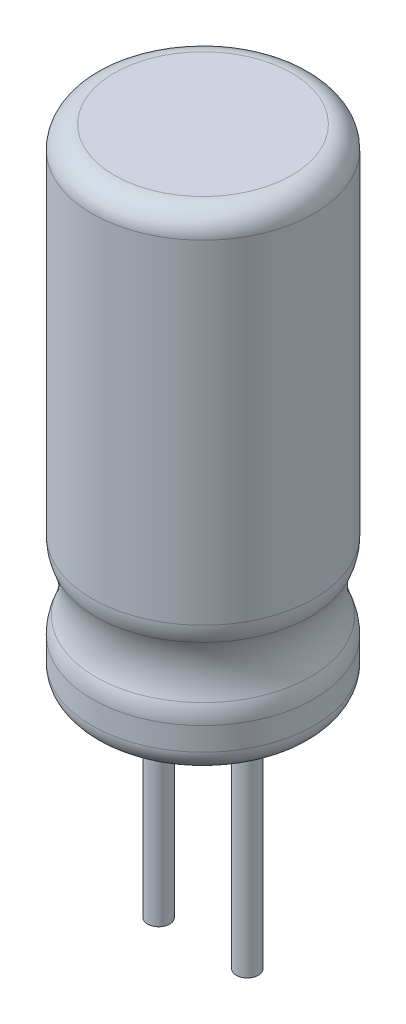
ISO-10303-21;
HEADER;
FILE_DESCRIPTION(('STEP AP214'),'2;1');
FILE_NAME('part.step','',(''),(''),'','','');
FILE_SCHEMA(('AUTOMOTIVE_DESIGN { 1 0 10303 214 1 1 1 1 }'));
ENDSEC;
DATA;
#1=APPLICATION_CONTEXT('core data for automotive mechanical design processes');
#2=APPLICATION_PROTOCOL_DEFINITION('international standard','automotive_design',2000,#1);
#3=PRODUCT_CONTEXT('',#1,'mechanical');
#4=PRODUCT('Part','Part','',(#3));
#5=PRODUCT_RELATED_PRODUCT_CATEGORY('part','',(#4));
#6=PRODUCT_DEFINITION_FORMATION('','',#4);
#7=PRODUCT_DEFINITION_CONTEXT('part definition',#1,'design');
#8=PRODUCT_DEFINITION('design','',#6,#7);
#9=PRODUCT_DEFINITION_SHAPE('','',#8);
#10=(LENGTH_UNIT() NAMED_UNIT(*) SI_UNIT(.MILLI.,.METRE.));
#11=(NAMED_UNIT(*) PLANE_ANGLE_UNIT() SI_UNIT($,.RADIAN.));
#12=(NAMED_UNIT(*) SI_UNIT($,.STERADIAN.) SOLID_ANGLE_UNIT());
#13=UNCERTAINTY_MEASURE_WITH_UNIT(LENGTH_MEASURE(1.E-05),#10,'distance_accuracy_value','');
#14=(GEOMETRIC_REPRESENTATION_CONTEXT(3) GLOBAL_UNCERTAINTY_ASSIGNED_CONTEXT((#13)) GLOBAL_UNIT_ASSIGNED_CONTEXT((#10,
#11,#12)) REPRESENTATION_CONTEXT('',''));
#15=CARTESIAN_POINT('',(0.,0.,0.));
#16=DIRECTION('',(0.,0.,1.));
#17=DIRECTION('',(1.,0.,0.));
#18=AXIS2_PLACEMENT_3D('',#15,#16,#17);
#19=CARTESIAN_POINT('',(0.,11.,0.));
#20=DIRECTION('',(0.,-1.,0.));
#21=DIRECTION('',(0.,0.,-1.));
#22=AXIS2_PLACEMENT_3D('',#19,#20,#21);
#23=CYLINDRICAL_SURFACE('',#22,2.5);
#24=CARTESIAN_POINT('',(0.,0.5,0.));
#25=DIRECTION('',(0.,1.,0.));
#26=DIRECTION('',(0.,0.,1.));
#27=AXIS2_PLACEMENT_3D('',#24,#25,#26);
#28=CIRCLE('',#27,2.5);
#29=CARTESIAN_POINT('',(0.,0.5,2.5));
#30=VERTEX_POINT('',#29);
#31=EDGE_CURVE('E51',#30,#30,#28,.T.);
#32=ORIENTED_EDGE('',*,*,#31,.T.);
#33=EDGE_LOOP('',(#32));
#34=FACE_BOUND('',#33,.T.);
#35=CARTESIAN_POINT('',(0.,1.02020410288673,0.));
#36=DIRECTION('',(0.,-1.,0.));
#37=DIRECTION('',(0.,0.,-1.));
#38=AXIS2_PLACEMENT_3D('',#35,#36,#37);
#39=CIRCLE('',#38,2.5);
#40=CARTESIAN_POINT('',(0.,1.02020410288673,-2.5));
#41=VERTEX_POINT('',#40);
#42=EDGE_CURVE('E75',#41,#41,#39,.T.);
#43=ORIENTED_EDGE('',*,*,#42,.T.);
#44=EDGE_LOOP('',(#43));
#45=FACE_BOUND('',#44,.T.);
#46=ADVANCED_FACE('F43',(#34,#45),#23,.T.);
#47=CARTESIAN_POINT('',(0.,0.,0.));
#48=DIRECTION('',(0.,1.,0.));
#49=DIRECTION('',(0.,0.,1.));
#50=AXIS2_PLACEMENT_3D('',#47,#48,#49);
#51=PLANE('',#50);
#52=CARTESIAN_POINT('',(0.,0.,0.));
#53=DIRECTION('',(0.,1.,0.));
#54=DIRECTION('',(0.,0.,1.));
#55=AXIS2_PLACEMENT_3D('',#52,#53,#54);
#56=CIRCLE('',#55,2.);
#57=CARTESIAN_POINT('',(0.,0.,2.));
#58=VERTEX_POINT('',#57);
#59=EDGE_CURVE('E10',#58,#58,#56,.F.);
#60=ORIENTED_EDGE('',*,*,#59,.T.);
#61=EDGE_LOOP('',(#60));
#62=FACE_BOUND('',#61,.T.);
#63=CARTESIAN_POINT('',(-1.,0.,0.));
#64=DIRECTION('',(0.,1.,0.));
#65=DIRECTION('',(0.,0.,1.));
#66=AXIS2_PLACEMENT_3D('',#63,#64,#65);
#67=CIRCLE('',#66,0.25);
#68=CARTESIAN_POINT('',(-1.,0.,0.25));
#69=VERTEX_POINT('',#68);
#70=EDGE_CURVE('E86',#69,#69,#67,.F.);
#71=ORIENTED_EDGE('',*,*,#70,.F.);
#72=EDGE_LOOP('',(#71));
#73=FACE_BOUND('',#72,.T.);
#74=CARTESIAN_POINT('',(1.,0.,0.));
#75=DIRECTION('',(0.,1.,0.));
#76=DIRECTION('',(0.,0.,1.));
#77=AXIS2_PLACEMENT_3D('',#74,#75,#76);
#78=CIRCLE('',#77,0.25);
#79=CARTESIAN_POINT('',(1.,0.,0.25));
#80=VERTEX_POINT('',#79);
#81=EDGE_CURVE('E90',#80,#80,#78,.F.);
#82=ORIENTED_EDGE('',*,*,#81,.F.);
#83=EDGE_LOOP('',(#82));
#84=FACE_BOUND('',#83,.T.);
#85=ADVANCED_FACE('F112',(#62,#73,#84),#51,.F.);
#86=CARTESIAN_POINT('',(1.,-5.,0.));
#87=DIRECTION('',(0.,1.,0.));
#88=DIRECTION('',(0.,0.,1.));
#89=AXIS2_PLACEMENT_3D('',#86,#87,#88);
#90=CYLINDRICAL_SURFACE('',#89,0.25);
#91=CARTESIAN_POINT('',(1.,-5.,0.));
#92=DIRECTION('',(0.,-1.,0.));
#93=DIRECTION('',(0.,0.,-1.));
#94=AXIS2_PLACEMENT_3D('',#91,#92,#93);
#95=CIRCLE('',#94,0.25);
#96=CARTESIAN_POINT('',(1.,-5.,-0.25));
#97=VERTEX_POINT('',#96);
#98=EDGE_CURVE('E93',#97,#97,#95,.T.);
#99=ORIENTED_EDGE('',*,*,#98,.F.);
#100=EDGE_LOOP('',(#99));
#101=FACE_BOUND('',#100,.T.);
#102=ORIENTED_EDGE('',*,*,#81,.T.);
#103=EDGE_LOOP('',(#102));
#104=FACE_BOUND('',#103,.T.);
#105=ADVANCED_FACE('F115',(#101,#104),#90,.T.);
#106=CARTESIAN_POINT('',(1.,-5.,0.));
#107=DIRECTION('',(0.,-1.,0.));
#108=DIRECTION('',(0.,0.,-1.));
#109=AXIS2_PLACEMENT_3D('',#106,#107,#108);
#110=PLANE('',#109);
#111=ORIENTED_EDGE('',*,*,#98,.T.);
#112=EDGE_LOOP('',(#111));
#113=FACE_BOUND('',#112,.T.);
#114=ADVANCED_FACE('F108',(#113),#110,.T.);
#115=CARTESIAN_POINT('',(-1.,-5.,0.));
#116=DIRECTION('',(0.,1.,0.));
#117=DIRECTION('',(0.,0.,1.));
#118=AXIS2_PLACEMENT_3D('',#115,#116,#117);
#119=CYLINDRICAL_SURFACE('',#118,0.25);
#120=CARTESIAN_POINT('',(-1.,-5.,0.));
#121=DIRECTION('',(0.,-1.,0.));
#122=DIRECTION('',(0.,0.,-1.));
#123=AXIS2_PLACEMENT_3D('',#120,#121,#122);
#124=CIRCLE('',#123,0.25);
#125=CARTESIAN_POINT('',(-1.,-5.,-0.25));
#126=VERTEX_POINT('',#125);
#127=EDGE_CURVE('E97',#126,#126,#124,.T.);
#128=ORIENTED_EDGE('',*,*,#127,.F.);
#129=EDGE_LOOP('',(#128));
#130=FACE_BOUND('',#129,.T.);
#131=ORIENTED_EDGE('',*,*,#70,.T.);
#132=EDGE_LOOP('',(#131));
#133=FACE_BOUND('',#132,.T.);
#134=ADVANCED_FACE('F105',(#130,#133),#119,.T.);
#135=CARTESIAN_POINT('',(-1.,-5.,0.));
#136=DIRECTION('',(0.,-1.,0.));
#137=DIRECTION('',(0.,0.,-1.));
#138=AXIS2_PLACEMENT_3D('',#135,#136,#137);
#139=PLANE('',#138);
#140=ORIENTED_EDGE('',*,*,#127,.T.);
#141=EDGE_LOOP('',(#140));
#142=FACE_BOUND('',#141,.T.);
#143=ADVANCED_FACE('F103',(#142),#139,.T.);
#144=CARTESIAN_POINT('',(0.,2.,0.));
#145=DIRECTION('',(0.,1.,0.));
#146=DIRECTION('',(0.,0.,1.));
#147=AXIS2_PLACEMENT_3D('',#144,#145,#146);
#148=TOROIDAL_SURFACE('',#147,3.8,1.5);
#149=CARTESIAN_POINT('',(0.,1.41212246173203,0.));
#150=DIRECTION('',(0.,1.,0.));
#151=DIRECTION('',(0.,0.,1.));
#152=AXIS2_PLACEMENT_3D('',#149,#150,#151);
#153=CIRCLE('',#152,2.42);
#154=CARTESIAN_POINT('',(0.,1.41212246173203,2.42));
#155=VERTEX_POINT('',#154);
#156=EDGE_CURVE('E79',#155,#155,#153,.T.);
#157=ORIENTED_EDGE('',*,*,#156,.T.);
#158=EDGE_LOOP('',(#157));
#159=FACE_BOUND('',#158,.T.);
#160=CARTESIAN_POINT('',(0.,2.58787753826797,0.));
#161=DIRECTION('',(0.,-1.,0.));
#162=DIRECTION('',(0.,0.,-1.));
#163=AXIS2_PLACEMENT_3D('',#160,#161,#162);
#164=CIRCLE('',#163,2.42);
#165=CARTESIAN_POINT('',(0.,2.58787753826797,-2.42));
#166=VERTEX_POINT('',#165);
#167=EDGE_CURVE('E83',#166,#166,#164,.T.);
#168=ORIENTED_EDGE('',*,*,#167,.T.);
#169=EDGE_LOOP('',(#168));
#170=FACE_BOUND('',#169,.T.);
#171=ADVANCED_FACE('F146',(#159,#170),#148,.F.);
#172=CARTESIAN_POINT('',(0.,11.,0.));
#173=DIRECTION('',(0.,1.,0.));
#174=DIRECTION('',(0.,0.,1.));
#175=AXIS2_PLACEMENT_3D('',#172,#173,#174);
#176=PLANE('',#175);
#177=CARTESIAN_POINT('',(0.,11.,0.));
#178=DIRECTION('',(0.,1.,0.));
#179=DIRECTION('',(0.,0.,1.));
#180=AXIS2_PLACEMENT_3D('',#177,#178,#179);
#181=CIRCLE('',#180,2.);
#182=CARTESIAN_POINT('',(0.,11.,2.));
#183=VERTEX_POINT('',#182);
#184=EDGE_CURVE('E66',#183,#183,#181,.T.);
#185=ORIENTED_EDGE('',*,*,#184,.T.);
#186=EDGE_LOOP('',(#185));
#187=FACE_BOUND('',#186,.T.);
#188=ADVANCED_FACE('F138',(#187),#176,.T.);
#189=CARTESIAN_POINT('',(0.,10.5,0.));
#190=DIRECTION('',(0.,1.,0.));
#191=DIRECTION('',(0.,0.,1.));
#192=AXIS2_PLACEMENT_3D('',#189,#190,#191);
#193=CIRCLE('',#192,2.5);
#194=CARTESIAN_POINT('',(0.,10.5,2.5));
#195=VERTEX_POINT('',#194);
#196=EDGE_CURVE('E59',#195,#195,#193,.F.);
#197=ORIENTED_EDGE('',*,*,#196,.T.);
#198=EDGE_LOOP('',(#197));
#199=FACE_BOUND('',#198,.T.);
#200=CARTESIAN_POINT('',(0.,2.97979589711328,0.));
#201=DIRECTION('',(0.,1.,0.));
#202=DIRECTION('',(0.,0.,1.));
#203=AXIS2_PLACEMENT_3D('',#200,#201,#202);
#204=CIRCLE('',#203,2.5);
#205=CARTESIAN_POINT('',(0.,2.97979589711328,2.5));
#206=VERTEX_POINT('',#205);
#207=EDGE_CURVE('E72',#206,#206,#204,.T.);
#208=ORIENTED_EDGE('',*,*,#207,.T.);
#209=EDGE_LOOP('',(#208));
#210=FACE_BOUND('',#209,.T.);
#211=ADVANCED_FACE('F131',(#199,#210),#23,.T.);
#212=CARTESIAN_POINT('',(0.,1.02020410288673,0.));
#213=DIRECTION('',(0.,-1.,0.));
#214=DIRECTION('',(0.,0.,-1.));
#215=AXIS2_PLACEMENT_3D('',#212,#213,#214);
#216=TOROIDAL_SURFACE('',#215,1.5,1.);
#217=ORIENTED_EDGE('',*,*,#42,.F.);
#218=EDGE_LOOP('',(#217));
#219=FACE_BOUND('',#218,.T.);
#220=ORIENTED_EDGE('',*,*,#156,.F.);
#221=EDGE_LOOP('',(#220));
#222=FACE_BOUND('',#221,.T.);
#223=ADVANCED_FACE('F137',(#219,#222),#216,.T.);
#224=CARTESIAN_POINT('',(0.,2.97979589711327,0.));
#225=DIRECTION('',(0.,1.,0.));
#226=DIRECTION('',(0.,0.,1.));
#227=AXIS2_PLACEMENT_3D('',#224,#225,#226);
#228=TOROIDAL_SURFACE('',#227,1.5,1.);
#229=ORIENTED_EDGE('',*,*,#207,.F.);
#230=EDGE_LOOP('',(#229));
#231=FACE_BOUND('',#230,.T.);
#232=ORIENTED_EDGE('',*,*,#167,.F.);
#233=EDGE_LOOP('',(#232));
#234=FACE_BOUND('',#233,.T.);
#235=ADVANCED_FACE('F144',(#231,#234),#228,.T.);
#236=CARTESIAN_POINT('',(0.,10.5,0.));
#237=DIRECTION('',(0.,1.,0.));
#238=DIRECTION('',(0.,0.,1.));
#239=AXIS2_PLACEMENT_3D('',#236,#237,#238);
#240=TOROIDAL_SURFACE('',#239,2.,0.5);
#241=ORIENTED_EDGE('',*,*,#196,.F.);
#242=EDGE_LOOP('',(#241));
#243=FACE_BOUND('',#242,.T.);
#244=ORIENTED_EDGE('',*,*,#184,.F.);
#245=EDGE_LOOP('',(#244));
#246=FACE_BOUND('',#245,.T.);
#247=ADVANCED_FACE('F154',(#243,#246),#240,.T.);
#248=CARTESIAN_POINT('',(0.,0.5,0.));
#249=DIRECTION('',(0.,1.,0.));
#250=DIRECTION('',(0.,0.,1.));
#251=AXIS2_PLACEMENT_3D('',#248,#249,#250);
#252=TOROIDAL_SURFACE('',#251,2.,0.5);
#253=ORIENTED_EDGE('',*,*,#59,.F.);
#254=EDGE_LOOP('',(#253));
#255=FACE_BOUND('',#254,.T.);
#256=ORIENTED_EDGE('',*,*,#31,.F.);
#257=EDGE_LOOP('',(#256));
#258=FACE_BOUND('',#257,.T.);
#259=ADVANCED_FACE('F45',(#255,#258),#252,.T.);
#260=CLOSED_SHELL('',(#46,#85,#105,#114,#134,#143,#171,#188,#211,#223,#235,#247,#259));
#261=MANIFOLD_SOLID_BREP('B2',#260);
#262=ADVANCED_BREP_SHAPE_REPRESENTATION('',(#18,#261),#14);
#263=SHAPE_DEFINITION_REPRESENTATION(#9,#262);
ENDSEC;
END-ISO-10303-21;
